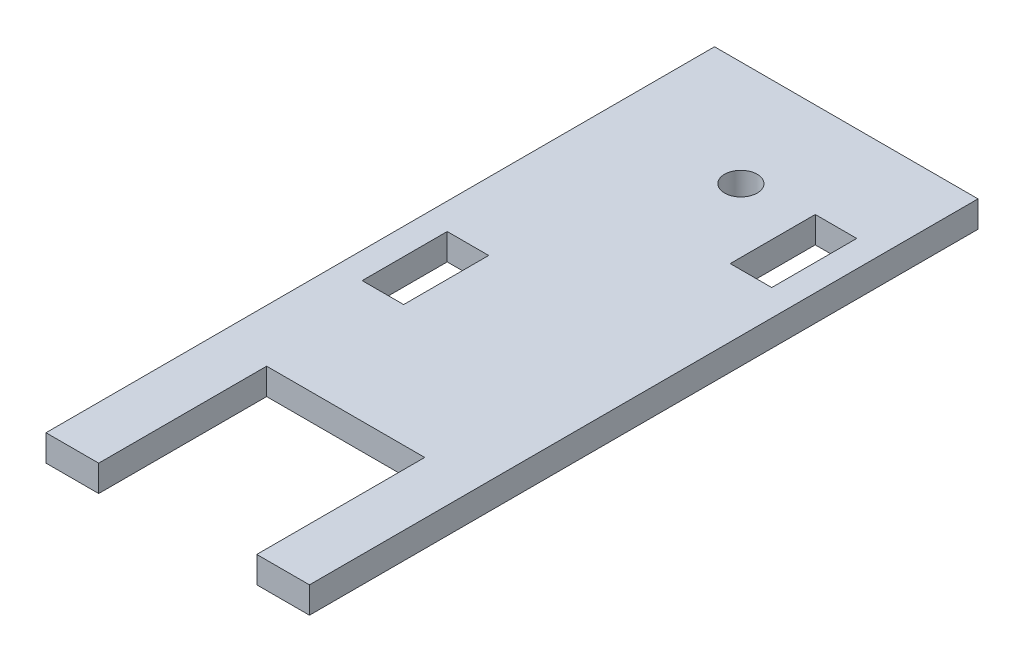
ISO-10303-21;
HEADER;
FILE_DESCRIPTION(('STEP AP214'),'2;1');
FILE_NAME('part.step','',(''),(''),'','','');
FILE_SCHEMA(('AUTOMOTIVE_DESIGN { 1 0 10303 214 1 1 1 1 }'));
ENDSEC;
DATA;
#1=APPLICATION_CONTEXT('core data for automotive mechanical design processes');
#2=APPLICATION_PROTOCOL_DEFINITION('international standard','automotive_design',2000,#1);
#3=PRODUCT_CONTEXT('',#1,'mechanical');
#4=PRODUCT('Part','Part','',(#3));
#5=PRODUCT_RELATED_PRODUCT_CATEGORY('part','',(#4));
#6=PRODUCT_DEFINITION_FORMATION('','',#4);
#7=PRODUCT_DEFINITION_CONTEXT('part definition',#1,'design');
#8=PRODUCT_DEFINITION('design','',#6,#7);
#9=PRODUCT_DEFINITION_SHAPE('','',#8);
#10=(LENGTH_UNIT() NAMED_UNIT(*) SI_UNIT(.MILLI.,.METRE.));
#11=(NAMED_UNIT(*) PLANE_ANGLE_UNIT() SI_UNIT($,.RADIAN.));
#12=(NAMED_UNIT(*) SI_UNIT($,.STERADIAN.) SOLID_ANGLE_UNIT());
#13=UNCERTAINTY_MEASURE_WITH_UNIT(LENGTH_MEASURE(1.E-05),#10,'distance_accuracy_value','');
#14=(GEOMETRIC_REPRESENTATION_CONTEXT(3) GLOBAL_UNCERTAINTY_ASSIGNED_CONTEXT((#13)) GLOBAL_UNIT_ASSIGNED_CONTEXT((#10,
#11,#12)) REPRESENTATION_CONTEXT('',''));
#15=CARTESIAN_POINT('',(0.,0.,0.));
#16=DIRECTION('',(0.,0.,1.));
#17=DIRECTION('',(1.,0.,0.));
#18=AXIS2_PLACEMENT_3D('',#15,#16,#17);
#19=CARTESIAN_POINT('',(0.,12.7,-241.3));
#20=DIRECTION('',(0.,0.,-1.));
#21=DIRECTION('',(-1.,0.,0.));
#22=AXIS2_PLACEMENT_3D('',#19,#20,#21);
#23=PLANE('',#22);
#24=DIRECTION('',(1.,0.,0.));
#25=VECTOR('',#24,1.);
#26=CARTESIAN_POINT('',(0.,0.,-241.3));
#27=LINE('',#26,#25);
#28=CARTESIAN_POINT('',(0.,0.,-241.3));
#29=VERTEX_POINT('',#28);
#30=CARTESIAN_POINT('',(127.,0.,-241.3));
#31=VERTEX_POINT('',#30);
#32=EDGE_CURVE('E245',#29,#31,#27,.T.);
#33=ORIENTED_EDGE('',*,*,#32,.F.);
#34=DIRECTION('',(0.,-1.,0.));
#35=VECTOR('',#34,1.);
#36=CARTESIAN_POINT('',(0.,12.7,-241.3));
#37=LINE('',#36,#35);
#38=CARTESIAN_POINT('',(0.,12.7,-241.3));
#39=VERTEX_POINT('',#38);
#40=EDGE_CURVE('E11',#39,#29,#37,.T.);
#41=ORIENTED_EDGE('',*,*,#40,.F.);
#42=DIRECTION('',(1.,0.,0.));
#43=VECTOR('',#42,1.);
#44=CARTESIAN_POINT('',(0.,12.7,-241.3));
#45=LINE('',#44,#43);
#46=CARTESIAN_POINT('',(127.,12.7,-241.3));
#47=VERTEX_POINT('',#46);
#48=EDGE_CURVE('E219',#39,#47,#45,.T.);
#49=ORIENTED_EDGE('',*,*,#48,.T.);
#50=DIRECTION('',(0.,-1.,0.));
#51=VECTOR('',#50,1.);
#52=CARTESIAN_POINT('',(127.,12.7,-241.3));
#53=LINE('',#52,#51);
#54=EDGE_CURVE('E242',#47,#31,#53,.T.);
#55=ORIENTED_EDGE('',*,*,#54,.T.);
#56=EDGE_LOOP('',(#33,#41,#49,#55));
#57=FACE_BOUND('',#56,.T.);
#58=ADVANCED_FACE('F35',(#57),#23,.T.);
#59=CARTESIAN_POINT('',(0.,12.7,0.));
#60=DIRECTION('',(-1.,0.,0.));
#61=DIRECTION('',(0.,0.,1.));
#62=AXIS2_PLACEMENT_3D('',#59,#60,#61);
#63=PLANE('',#62);
#64=DIRECTION('',(0.,0.,-1.));
#65=VECTOR('',#64,1.);
#66=CARTESIAN_POINT('',(0.,0.,0.));
#67=LINE('',#66,#65);
#68=CARTESIAN_POINT('',(0.,0.,80.9625));
#69=VERTEX_POINT('',#68);
#70=EDGE_CURVE('E248',#69,#29,#67,.T.);
#71=ORIENTED_EDGE('',*,*,#70,.F.);
#72=DIRECTION('',(0.,-1.,0.));
#73=VECTOR('',#72,1.);
#74=CARTESIAN_POINT('',(0.,12.7,80.9625));
#75=LINE('',#74,#73);
#76=CARTESIAN_POINT('',(0.,12.7,80.9625));
#77=VERTEX_POINT('',#76);
#78=EDGE_CURVE('E43',#77,#69,#75,.T.);
#79=ORIENTED_EDGE('',*,*,#78,.F.);
#80=DIRECTION('',(0.,0.,-1.));
#81=VECTOR('',#80,1.);
#82=CARTESIAN_POINT('',(0.,12.7,0.));
#83=LINE('',#82,#81);
#84=EDGE_CURVE('E223',#77,#39,#83,.T.);
#85=ORIENTED_EDGE('',*,*,#84,.T.);
#86=ORIENTED_EDGE('',*,*,#40,.T.);
#87=EDGE_LOOP('',(#71,#79,#85,#86));
#88=FACE_BOUND('',#87,.T.);
#89=ADVANCED_FACE('F286',(#88),#63,.T.);
#90=CARTESIAN_POINT('',(0.,12.7,80.9625));
#91=DIRECTION('',(0.,0.,1.));
#92=DIRECTION('',(1.,0.,0.));
#93=AXIS2_PLACEMENT_3D('',#90,#91,#92);
#94=PLANE('',#93);
#95=DIRECTION('',(-1.,0.,0.));
#96=VECTOR('',#95,1.);
#97=CARTESIAN_POINT('',(0.,0.,80.9625));
#98=LINE('',#97,#96);
#99=CARTESIAN_POINT('',(25.4,0.,80.9625));
#100=VERTEX_POINT('',#99);
#101=EDGE_CURVE('E251',#100,#69,#98,.T.);
#102=ORIENTED_EDGE('',*,*,#101,.F.);
#103=DIRECTION('',(0.,-1.,0.));
#104=VECTOR('',#103,1.);
#105=CARTESIAN_POINT('',(25.4,12.7,80.9625));
#106=LINE('',#105,#104);
#107=CARTESIAN_POINT('',(25.4,12.7,80.9625));
#108=VERTEX_POINT('',#107);
#109=EDGE_CURVE('E278',#108,#100,#106,.T.);
#110=ORIENTED_EDGE('',*,*,#109,.F.);
#111=DIRECTION('',(-1.,0.,0.));
#112=VECTOR('',#111,1.);
#113=CARTESIAN_POINT('',(0.,12.7,80.9625));
#114=LINE('',#113,#112);
#115=EDGE_CURVE('E226',#108,#77,#114,.T.);
#116=ORIENTED_EDGE('',*,*,#115,.T.);
#117=ORIENTED_EDGE('',*,*,#78,.T.);
#118=EDGE_LOOP('',(#102,#110,#116,#117));
#119=FACE_BOUND('',#118,.T.);
#120=ADVANCED_FACE('F282',(#119),#94,.T.);
#121=CARTESIAN_POINT('',(25.4,12.7,0.));
#122=DIRECTION('',(1.,0.,0.));
#123=DIRECTION('',(0.,0.,-1.));
#124=AXIS2_PLACEMENT_3D('',#121,#122,#123);
#125=PLANE('',#124);
#126=DIRECTION('',(0.,0.,1.));
#127=VECTOR('',#126,1.);
#128=CARTESIAN_POINT('',(25.4,0.,0.));
#129=LINE('',#128,#127);
#130=CARTESIAN_POINT('',(25.4,0.,0.));
#131=VERTEX_POINT('',#130);
#132=EDGE_CURVE('E254',#131,#100,#129,.T.);
#133=ORIENTED_EDGE('',*,*,#132,.F.);
#134=DIRECTION('',(0.,-1.,0.));
#135=VECTOR('',#134,1.);
#136=CARTESIAN_POINT('',(25.4,12.7,0.));
#137=LINE('',#136,#135);
#138=CARTESIAN_POINT('',(25.4,12.7,0.));
#139=VERTEX_POINT('',#138);
#140=EDGE_CURVE('E276',#139,#131,#137,.T.);
#141=ORIENTED_EDGE('',*,*,#140,.F.);
#142=DIRECTION('',(0.,0.,1.));
#143=VECTOR('',#142,1.);
#144=CARTESIAN_POINT('',(25.4,12.7,0.));
#145=LINE('',#144,#143);
#146=EDGE_CURVE('E229',#139,#108,#145,.T.);
#147=ORIENTED_EDGE('',*,*,#146,.T.);
#148=ORIENTED_EDGE('',*,*,#109,.T.);
#149=EDGE_LOOP('',(#133,#141,#147,#148));
#150=FACE_BOUND('',#149,.T.);
#151=ADVANCED_FACE('F293',(#150),#125,.T.);
#152=CARTESIAN_POINT('',(0.,12.7,0.));
#153=DIRECTION('',(0.,0.,-1.));
#154=DIRECTION('',(-1.,0.,0.));
#155=AXIS2_PLACEMENT_3D('',#152,#153,#154);
#156=PLANE('',#155);
#157=DIRECTION('',(1.,0.,0.));
#158=VECTOR('',#157,1.);
#159=CARTESIAN_POINT('',(0.,0.,0.));
#160=LINE('',#159,#158);
#161=CARTESIAN_POINT('',(101.6,0.,0.));
#162=VERTEX_POINT('',#161);
#163=EDGE_CURVE('E257',#131,#162,#160,.T.);
#164=ORIENTED_EDGE('',*,*,#163,.T.);
#165=DIRECTION('',(0.,-1.,0.));
#166=VECTOR('',#165,1.);
#167=CARTESIAN_POINT('',(101.6,12.7,0.));
#168=LINE('',#167,#166);
#169=CARTESIAN_POINT('',(101.6,12.7,0.));
#170=VERTEX_POINT('',#169);
#171=EDGE_CURVE('E273',#170,#162,#168,.T.);
#172=ORIENTED_EDGE('',*,*,#171,.F.);
#173=DIRECTION('',(1.,0.,0.));
#174=VECTOR('',#173,1.);
#175=CARTESIAN_POINT('',(0.,12.7,0.));
#176=LINE('',#175,#174);
#177=EDGE_CURVE('E232',#139,#170,#176,.T.);
#178=ORIENTED_EDGE('',*,*,#177,.F.);
#179=ORIENTED_EDGE('',*,*,#140,.T.);
#180=EDGE_LOOP('',(#164,#172,#178,#179));
#181=FACE_BOUND('',#180,.T.);
#182=ADVANCED_FACE('F312',(#181),#156,.F.);
#183=CARTESIAN_POINT('',(101.6,12.7,0.));
#184=DIRECTION('',(1.,0.,0.));
#185=DIRECTION('',(0.,0.,-1.));
#186=AXIS2_PLACEMENT_3D('',#183,#184,#185);
#187=PLANE('',#186);
#188=DIRECTION('',(0.,0.,1.));
#189=VECTOR('',#188,1.);
#190=CARTESIAN_POINT('',(101.6,0.,0.));
#191=LINE('',#190,#189);
#192=CARTESIAN_POINT('',(101.6,0.,80.9625));
#193=VERTEX_POINT('',#192);
#194=EDGE_CURVE('E260',#162,#193,#191,.T.);
#195=ORIENTED_EDGE('',*,*,#194,.T.);
#196=DIRECTION('',(0.,-1.,0.));
#197=VECTOR('',#196,1.);
#198=CARTESIAN_POINT('',(101.6,12.7,80.9625));
#199=LINE('',#198,#197);
#200=CARTESIAN_POINT('',(101.6,12.7,80.9625));
#201=VERTEX_POINT('',#200);
#202=EDGE_CURVE('E271',#201,#193,#199,.T.);
#203=ORIENTED_EDGE('',*,*,#202,.F.);
#204=DIRECTION('',(0.,0.,1.));
#205=VECTOR('',#204,1.);
#206=CARTESIAN_POINT('',(101.6,12.7,0.));
#207=LINE('',#206,#205);
#208=EDGE_CURVE('E235',#170,#201,#207,.T.);
#209=ORIENTED_EDGE('',*,*,#208,.F.);
#210=ORIENTED_EDGE('',*,*,#171,.T.);
#211=EDGE_LOOP('',(#195,#203,#209,#210));
#212=FACE_BOUND('',#211,.T.);
#213=ADVANCED_FACE('F309',(#212),#187,.F.);
#214=CARTESIAN_POINT('',(0.,12.7,80.9625));
#215=DIRECTION('',(0.,0.,1.));
#216=DIRECTION('',(1.,0.,0.));
#217=AXIS2_PLACEMENT_3D('',#214,#215,#216);
#218=PLANE('',#217);
#219=DIRECTION('',(-1.,0.,0.));
#220=VECTOR('',#219,1.);
#221=CARTESIAN_POINT('',(0.,0.,80.9625));
#222=LINE('',#221,#220);
#223=CARTESIAN_POINT('',(127.,0.,80.9625));
#224=VERTEX_POINT('',#223);
#225=EDGE_CURVE('E263',#224,#193,#222,.T.);
#226=ORIENTED_EDGE('',*,*,#225,.F.);
#227=DIRECTION('',(0.,-1.,0.));
#228=VECTOR('',#227,1.);
#229=CARTESIAN_POINT('',(127.,12.7,80.9625));
#230=LINE('',#229,#228);
#231=CARTESIAN_POINT('',(127.,12.7,80.9625));
#232=VERTEX_POINT('',#231);
#233=EDGE_CURVE('E269',#232,#224,#230,.T.);
#234=ORIENTED_EDGE('',*,*,#233,.F.);
#235=DIRECTION('',(-1.,0.,0.));
#236=VECTOR('',#235,1.);
#237=CARTESIAN_POINT('',(0.,12.7,80.9625));
#238=LINE('',#237,#236);
#239=EDGE_CURVE('E237',#232,#201,#238,.T.);
#240=ORIENTED_EDGE('',*,*,#239,.T.);
#241=ORIENTED_EDGE('',*,*,#202,.T.);
#242=EDGE_LOOP('',(#226,#234,#240,#241));
#243=FACE_BOUND('',#242,.T.);
#244=ADVANCED_FACE('F306',(#243),#218,.T.);
#245=CARTESIAN_POINT('',(63.5,12.7,-190.5));
#246=DIRECTION('',(0.,-1.,0.));
#247=DIRECTION('',(0.,0.,-1.));
#248=AXIS2_PLACEMENT_3D('',#245,#246,#247);
#249=CYLINDRICAL_SURFACE('',#248,7.874);
#250=CARTESIAN_POINT('',(63.5,12.7,-190.5));
#251=DIRECTION('',(0.,1.,0.));
#252=DIRECTION('',(0.,0.,1.));
#253=AXIS2_PLACEMENT_3D('',#250,#251,#252);
#254=CIRCLE('',#253,7.874);
#255=CARTESIAN_POINT('',(63.5,12.7,-182.626));
#256=VERTEX_POINT('',#255);
#257=EDGE_CURVE('E216',#256,#256,#254,.T.);
#258=ORIENTED_EDGE('',*,*,#257,.T.);
#259=EDGE_LOOP('',(#258));
#260=FACE_BOUND('',#259,.T.);
#261=CARTESIAN_POINT('',(63.5,0.,-190.5));
#262=DIRECTION('',(0.,1.,0.));
#263=DIRECTION('',(0.,0.,1.));
#264=AXIS2_PLACEMENT_3D('',#261,#262,#263);
#265=CIRCLE('',#264,7.874);
#266=CARTESIAN_POINT('',(63.5,0.,-182.626));
#267=VERTEX_POINT('',#266);
#268=EDGE_CURVE('E209',#267,#267,#265,.T.);
#269=ORIENTED_EDGE('',*,*,#268,.F.);
#270=EDGE_LOOP('',(#269));
#271=FACE_BOUND('',#270,.T.);
#272=ADVANCED_FACE('F37',(#260,#271),#249,.F.);
#273=CARTESIAN_POINT('',(127.,12.7,0.));
#274=DIRECTION('',(-1.,0.,0.));
#275=DIRECTION('',(0.,0.,1.));
#276=AXIS2_PLACEMENT_3D('',#273,#274,#275);
#277=PLANE('',#276);
#278=DIRECTION('',(0.,0.,-1.));
#279=VECTOR('',#278,1.);
#280=CARTESIAN_POINT('',(127.,0.,0.));
#281=LINE('',#280,#279);
#282=EDGE_CURVE('E220',#224,#31,#281,.T.);
#283=ORIENTED_EDGE('',*,*,#282,.T.);
#284=ORIENTED_EDGE('',*,*,#54,.F.);
#285=DIRECTION('',(0.,0.,-1.));
#286=VECTOR('',#285,1.);
#287=CARTESIAN_POINT('',(127.,12.7,0.));
#288=LINE('',#287,#286);
#289=EDGE_CURVE('E240',#232,#47,#288,.T.);
#290=ORIENTED_EDGE('',*,*,#289,.F.);
#291=ORIENTED_EDGE('',*,*,#233,.T.);
#292=EDGE_LOOP('',(#283,#284,#290,#291));
#293=FACE_BOUND('',#292,.T.);
#294=ADVANCED_FACE('F365',(#293),#277,.F.);
#295=CARTESIAN_POINT('',(0.,12.7,0.));
#296=DIRECTION('',(0.,1.,0.));
#297=DIRECTION('',(0.,0.,1.));
#298=AXIS2_PLACEMENT_3D('',#295,#296,#297);
#299=PLANE('',#298);
#300=DIRECTION('',(0.,0.,-1.));
#301=VECTOR('',#300,1.);
#302=CARTESIAN_POINT('',(12.7,12.7,-58.7375));
#303=LINE('',#302,#301);
#304=CARTESIAN_POINT('',(12.7,12.7,-58.7375));
#305=VERTEX_POINT('',#304);
#306=CARTESIAN_POINT('',(12.7,12.7,-99.7375));
#307=VERTEX_POINT('',#306);
#308=EDGE_CURVE('E149',#305,#307,#303,.T.);
#309=ORIENTED_EDGE('',*,*,#308,.T.);
#310=DIRECTION('',(1.,0.,0.));
#311=VECTOR('',#310,1.);
#312=CARTESIAN_POINT('',(12.7,12.7,-99.7375));
#313=LINE('',#312,#311);
#314=CARTESIAN_POINT('',(32.7,12.7,-99.7375));
#315=VERTEX_POINT('',#314);
#316=EDGE_CURVE('E158',#307,#315,#313,.T.);
#317=ORIENTED_EDGE('',*,*,#316,.T.);
#318=DIRECTION('',(0.,0.,1.));
#319=VECTOR('',#318,1.);
#320=CARTESIAN_POINT('',(32.7,12.7,-58.7375));
#321=LINE('',#320,#319);
#322=CARTESIAN_POINT('',(32.7,12.7,-58.7375));
#323=VERTEX_POINT('',#322);
#324=EDGE_CURVE('E50',#315,#323,#321,.T.);
#325=ORIENTED_EDGE('',*,*,#324,.T.);
#326=DIRECTION('',(-1.,0.,0.));
#327=VECTOR('',#326,1.);
#328=CARTESIAN_POINT('',(12.7,12.7,-58.7375));
#329=LINE('',#328,#327);
#330=EDGE_CURVE('E155',#323,#305,#329,.T.);
#331=ORIENTED_EDGE('',*,*,#330,.T.);
#332=EDGE_LOOP('',(#309,#317,#325,#331));
#333=FACE_BOUND('',#332,.T.);
#334=DIRECTION('',(0.,0.,1.));
#335=VECTOR('',#334,1.);
#336=CARTESIAN_POINT('',(114.3,12.7,-195.55319538));
#337=LINE('',#336,#335);
#338=CARTESIAN_POINT('',(114.3,12.7,-195.55319538));
#339=VERTEX_POINT('',#338);
#340=CARTESIAN_POINT('',(114.3,12.7,-154.55319538));
#341=VERTEX_POINT('',#340);
#342=EDGE_CURVE('E184',#339,#341,#337,.T.);
#343=ORIENTED_EDGE('',*,*,#342,.T.);
#344=DIRECTION('',(-1.,0.,0.));
#345=VECTOR('',#344,1.);
#346=CARTESIAN_POINT('',(114.3,12.7,-154.55319538));
#347=LINE('',#346,#345);
#348=CARTESIAN_POINT('',(94.3,12.7,-154.55319538));
#349=VERTEX_POINT('',#348);
#350=EDGE_CURVE('E187',#341,#349,#347,.T.);
#351=ORIENTED_EDGE('',*,*,#350,.T.);
#352=DIRECTION('',(0.,0.,-1.));
#353=VECTOR('',#352,1.);
#354=CARTESIAN_POINT('',(94.3,12.7,-195.55319538));
#355=LINE('',#354,#353);
#356=CARTESIAN_POINT('',(94.3,12.7,-195.55319538));
#357=VERTEX_POINT('',#356);
#358=EDGE_CURVE('E191',#349,#357,#355,.T.);
#359=ORIENTED_EDGE('',*,*,#358,.T.);
#360=DIRECTION('',(1.,0.,0.));
#361=VECTOR('',#360,1.);
#362=CARTESIAN_POINT('',(114.3,12.7,-195.55319538));
#363=LINE('',#362,#361);
#364=EDGE_CURVE('E194',#357,#339,#363,.T.);
#365=ORIENTED_EDGE('',*,*,#364,.T.);
#366=EDGE_LOOP('',(#343,#351,#359,#365));
#367=FACE_BOUND('',#366,.T.);
#368=ORIENTED_EDGE('',*,*,#257,.F.);
#369=EDGE_LOOP('',(#368));
#370=FACE_BOUND('',#369,.T.);
#371=ORIENTED_EDGE('',*,*,#48,.F.);
#372=ORIENTED_EDGE('',*,*,#84,.F.);
#373=ORIENTED_EDGE('',*,*,#115,.F.);
#374=ORIENTED_EDGE('',*,*,#146,.F.);
#375=ORIENTED_EDGE('',*,*,#177,.T.);
#376=ORIENTED_EDGE('',*,*,#208,.T.);
#377=ORIENTED_EDGE('',*,*,#239,.F.);
#378=ORIENTED_EDGE('',*,*,#289,.T.);
#379=EDGE_LOOP('',(#371,#372,#373,#374,#375,#376,#377,#378));
#380=FACE_BOUND('',#379,.T.);
#381=ADVANCED_FACE('F162',(#333,#367,#370,#380),#299,.T.);
#382=CARTESIAN_POINT('',(0.,0.,0.));
#383=DIRECTION('',(0.,1.,0.));
#384=DIRECTION('',(0.,0.,1.));
#385=AXIS2_PLACEMENT_3D('',#382,#383,#384);
#386=PLANE('',#385);
#387=DIRECTION('',(1.,0.,0.));
#388=VECTOR('',#387,1.);
#389=CARTESIAN_POINT('',(12.7,0.,-99.7375));
#390=LINE('',#389,#388);
#391=CARTESIAN_POINT('',(12.7,0.,-99.7375));
#392=VERTEX_POINT('',#391);
#393=CARTESIAN_POINT('',(32.7,0.,-99.7375));
#394=VERTEX_POINT('',#393);
#395=EDGE_CURVE('E174',#392,#394,#390,.T.);
#396=ORIENTED_EDGE('',*,*,#395,.F.);
#397=DIRECTION('',(0.,0.,-1.));
#398=VECTOR('',#397,1.);
#399=CARTESIAN_POINT('',(12.7,0.,-58.7375));
#400=LINE('',#399,#398);
#401=CARTESIAN_POINT('',(12.7,0.,-58.7375));
#402=VERTEX_POINT('',#401);
#403=EDGE_CURVE('E58',#402,#392,#400,.T.);
#404=ORIENTED_EDGE('',*,*,#403,.F.);
#405=DIRECTION('',(-1.,0.,0.));
#406=VECTOR('',#405,1.);
#407=CARTESIAN_POINT('',(12.7,0.,-58.7375));
#408=LINE('',#407,#406);
#409=CARTESIAN_POINT('',(32.7,0.,-58.7375));
#410=VERTEX_POINT('',#409);
#411=EDGE_CURVE('E165',#410,#402,#408,.T.);
#412=ORIENTED_EDGE('',*,*,#411,.F.);
#413=DIRECTION('',(0.,0.,1.));
#414=VECTOR('',#413,1.);
#415=CARTESIAN_POINT('',(32.7,0.,-58.7375));
#416=LINE('',#415,#414);
#417=EDGE_CURVE('E168',#394,#410,#416,.T.);
#418=ORIENTED_EDGE('',*,*,#417,.F.);
#419=EDGE_LOOP('',(#396,#404,#412,#418));
#420=FACE_BOUND('',#419,.T.);
#421=DIRECTION('',(-1.,0.,0.));
#422=VECTOR('',#421,1.);
#423=CARTESIAN_POINT('',(114.3,0.,-154.55319538));
#424=LINE('',#423,#422);
#425=CARTESIAN_POINT('',(114.3,0.,-154.55319538));
#426=VERTEX_POINT('',#425);
#427=CARTESIAN_POINT('',(94.3,0.,-154.55319538));
#428=VERTEX_POINT('',#427);
#429=EDGE_CURVE('E199',#426,#428,#424,.T.);
#430=ORIENTED_EDGE('',*,*,#429,.F.);
#431=DIRECTION('',(0.,0.,1.));
#432=VECTOR('',#431,1.);
#433=CARTESIAN_POINT('',(114.3,0.,-195.55319538));
#434=LINE('',#433,#432);
#435=CARTESIAN_POINT('',(114.3,0.,-195.55319538));
#436=VERTEX_POINT('',#435);
#437=EDGE_CURVE('E180',#436,#426,#434,.T.);
#438=ORIENTED_EDGE('',*,*,#437,.F.);
#439=DIRECTION('',(1.,0.,0.));
#440=VECTOR('',#439,1.);
#441=CARTESIAN_POINT('',(114.3,0.,-195.55319538));
#442=LINE('',#441,#440);
#443=CARTESIAN_POINT('',(94.3,0.,-195.55319538));
#444=VERTEX_POINT('',#443);
#445=EDGE_CURVE('E188',#444,#436,#442,.T.);
#446=ORIENTED_EDGE('',*,*,#445,.F.);
#447=DIRECTION('',(0.,0.,-1.));
#448=VECTOR('',#447,1.);
#449=CARTESIAN_POINT('',(94.3,0.,-195.55319538));
#450=LINE('',#449,#448);
#451=EDGE_CURVE('E202',#428,#444,#450,.T.);
#452=ORIENTED_EDGE('',*,*,#451,.F.);
#453=EDGE_LOOP('',(#430,#438,#446,#452));
#454=FACE_BOUND('',#453,.T.);
#455=ORIENTED_EDGE('',*,*,#268,.T.);
#456=EDGE_LOOP('',(#455));
#457=FACE_BOUND('',#456,.T.);
#458=ORIENTED_EDGE('',*,*,#32,.T.);
#459=ORIENTED_EDGE('',*,*,#282,.F.);
#460=ORIENTED_EDGE('',*,*,#225,.T.);
#461=ORIENTED_EDGE('',*,*,#194,.F.);
#462=ORIENTED_EDGE('',*,*,#163,.F.);
#463=ORIENTED_EDGE('',*,*,#132,.T.);
#464=ORIENTED_EDGE('',*,*,#101,.T.);
#465=ORIENTED_EDGE('',*,*,#70,.T.);
#466=EDGE_LOOP('',(#458,#459,#460,#461,#462,#463,#464,#465));
#467=FACE_BOUND('',#466,.T.);
#468=ADVANCED_FACE('F289',(#420,#454,#457,#467),#386,.F.);
#469=CARTESIAN_POINT('',(114.3,12.7,-195.55319538));
#470=DIRECTION('',(1.,0.,0.));
#471=DIRECTION('',(0.,0.,-1.));
#472=AXIS2_PLACEMENT_3D('',#469,#470,#471);
#473=PLANE('',#472);
#474=ORIENTED_EDGE('',*,*,#437,.T.);
#475=DIRECTION('',(0.,-1.,0.));
#476=VECTOR('',#475,1.);
#477=CARTESIAN_POINT('',(114.3,12.7,-154.55319538));
#478=LINE('',#477,#476);
#479=EDGE_CURVE('E197',#341,#426,#478,.T.);
#480=ORIENTED_EDGE('',*,*,#479,.F.);
#481=ORIENTED_EDGE('',*,*,#342,.F.);
#482=DIRECTION('',(0.,-1.,0.));
#483=VECTOR('',#482,1.);
#484=CARTESIAN_POINT('',(114.3,12.7,-195.55319538));
#485=LINE('',#484,#483);
#486=EDGE_CURVE('E207',#339,#436,#485,.T.);
#487=ORIENTED_EDGE('',*,*,#486,.T.);
#488=EDGE_LOOP('',(#474,#480,#481,#487));
#489=FACE_BOUND('',#488,.T.);
#490=ADVANCED_FACE('F381',(#489),#473,.F.);
#491=CARTESIAN_POINT('',(114.3,12.7,-195.55319538));
#492=DIRECTION('',(0.,0.,-1.));
#493=DIRECTION('',(-1.,0.,0.));
#494=AXIS2_PLACEMENT_3D('',#491,#492,#493);
#495=PLANE('',#494);
#496=ORIENTED_EDGE('',*,*,#445,.T.);
#497=ORIENTED_EDGE('',*,*,#486,.F.);
#498=ORIENTED_EDGE('',*,*,#364,.F.);
#499=DIRECTION('',(0.,-1.,0.));
#500=VECTOR('',#499,1.);
#501=CARTESIAN_POINT('',(94.3,12.7,-195.55319538));
#502=LINE('',#501,#500);
#503=EDGE_CURVE('E210',#357,#444,#502,.T.);
#504=ORIENTED_EDGE('',*,*,#503,.T.);
#505=EDGE_LOOP('',(#496,#497,#498,#504));
#506=FACE_BOUND('',#505,.T.);
#507=ADVANCED_FACE('F386',(#506),#495,.F.);
#508=CARTESIAN_POINT('',(94.3,12.7,-195.55319538));
#509=DIRECTION('',(-1.,0.,0.));
#510=DIRECTION('',(0.,0.,1.));
#511=AXIS2_PLACEMENT_3D('',#508,#509,#510);
#512=PLANE('',#511);
#513=ORIENTED_EDGE('',*,*,#451,.T.);
#514=ORIENTED_EDGE('',*,*,#503,.F.);
#515=ORIENTED_EDGE('',*,*,#358,.F.);
#516=DIRECTION('',(0.,-1.,0.));
#517=VECTOR('',#516,1.);
#518=CARTESIAN_POINT('',(94.3,12.7,-154.55319538));
#519=LINE('',#518,#517);
#520=EDGE_CURVE('E212',#349,#428,#519,.T.);
#521=ORIENTED_EDGE('',*,*,#520,.T.);
#522=EDGE_LOOP('',(#513,#514,#515,#521));
#523=FACE_BOUND('',#522,.T.);
#524=ADVANCED_FACE('F398',(#523),#512,.F.);
#525=CARTESIAN_POINT('',(114.3,12.7,-154.55319538));
#526=DIRECTION('',(0.,0.,1.));
#527=DIRECTION('',(1.,0.,0.));
#528=AXIS2_PLACEMENT_3D('',#525,#526,#527);
#529=PLANE('',#528);
#530=ORIENTED_EDGE('',*,*,#429,.T.);
#531=ORIENTED_EDGE('',*,*,#520,.F.);
#532=ORIENTED_EDGE('',*,*,#350,.F.);
#533=ORIENTED_EDGE('',*,*,#479,.T.);
#534=EDGE_LOOP('',(#530,#531,#532,#533));
#535=FACE_BOUND('',#534,.T.);
#536=ADVANCED_FACE('F408',(#535),#529,.F.);
#537=CARTESIAN_POINT('',(12.7,12.7,-58.7375));
#538=DIRECTION('',(-1.,0.,0.));
#539=DIRECTION('',(0.,0.,1.));
#540=AXIS2_PLACEMENT_3D('',#537,#538,#539);
#541=PLANE('',#540);
#542=ORIENTED_EDGE('',*,*,#403,.T.);
#543=DIRECTION('',(0.,-1.,0.));
#544=VECTOR('',#543,1.);
#545=CARTESIAN_POINT('',(12.7,12.7,-99.7375));
#546=LINE('',#545,#544);
#547=EDGE_CURVE('E145',#307,#392,#546,.T.);
#548=ORIENTED_EDGE('',*,*,#547,.F.);
#549=ORIENTED_EDGE('',*,*,#308,.F.);
#550=DIRECTION('',(0.,-1.,0.));
#551=VECTOR('',#550,1.);
#552=CARTESIAN_POINT('',(12.7,12.7,-58.7375));
#553=LINE('',#552,#551);
#554=EDGE_CURVE('E178',#305,#402,#553,.T.);
#555=ORIENTED_EDGE('',*,*,#554,.T.);
#556=EDGE_LOOP('',(#542,#548,#549,#555));
#557=FACE_BOUND('',#556,.T.);
#558=ADVANCED_FACE('F147',(#557),#541,.F.);
#559=CARTESIAN_POINT('',(12.7,12.7,-58.7375));
#560=DIRECTION('',(0.,0.,1.));
#561=DIRECTION('',(1.,0.,0.));
#562=AXIS2_PLACEMENT_3D('',#559,#560,#561);
#563=PLANE('',#562);
#564=ORIENTED_EDGE('',*,*,#411,.T.);
#565=ORIENTED_EDGE('',*,*,#554,.F.);
#566=ORIENTED_EDGE('',*,*,#330,.F.);
#567=DIRECTION('',(0.,-1.,0.));
#568=VECTOR('',#567,1.);
#569=CARTESIAN_POINT('',(32.7,12.7,-58.7375));
#570=LINE('',#569,#568);
#571=EDGE_CURVE('E181',#323,#410,#570,.T.);
#572=ORIENTED_EDGE('',*,*,#571,.T.);
#573=EDGE_LOOP('',(#564,#565,#566,#572));
#574=FACE_BOUND('',#573,.T.);
#575=ADVANCED_FACE('F437',(#574),#563,.F.);
#576=CARTESIAN_POINT('',(32.7,12.7,-58.7375));
#577=DIRECTION('',(1.,0.,0.));
#578=DIRECTION('',(0.,0.,-1.));
#579=AXIS2_PLACEMENT_3D('',#576,#577,#578);
#580=PLANE('',#579);
#581=ORIENTED_EDGE('',*,*,#417,.T.);
#582=ORIENTED_EDGE('',*,*,#571,.F.);
#583=ORIENTED_EDGE('',*,*,#324,.F.);
#584=DIRECTION('',(0.,-1.,0.));
#585=VECTOR('',#584,1.);
#586=CARTESIAN_POINT('',(32.7,12.7,-99.7375));
#587=LINE('',#586,#585);
#588=EDGE_CURVE('E154',#315,#394,#587,.T.);
#589=ORIENTED_EDGE('',*,*,#588,.T.);
#590=EDGE_LOOP('',(#581,#582,#583,#589));
#591=FACE_BOUND('',#590,.T.);
#592=ADVANCED_FACE('F446',(#591),#580,.F.);
#593=CARTESIAN_POINT('',(12.7,12.7,-99.7375));
#594=DIRECTION('',(0.,0.,-1.));
#595=DIRECTION('',(-1.,0.,0.));
#596=AXIS2_PLACEMENT_3D('',#593,#594,#595);
#597=PLANE('',#596);
#598=ORIENTED_EDGE('',*,*,#395,.T.);
#599=ORIENTED_EDGE('',*,*,#588,.F.);
#600=ORIENTED_EDGE('',*,*,#316,.F.);
#601=ORIENTED_EDGE('',*,*,#547,.T.);
#602=EDGE_LOOP('',(#598,#599,#600,#601));
#603=FACE_BOUND('',#602,.T.);
#604=ADVANCED_FACE('F159',(#603),#597,.F.);
#605=CLOSED_SHELL('',(#58,#89,#120,#151,#182,#213,#244,#272,#294,#381,#468,#490,#507,#524,#536,
#558,#575,#592,#604));
#606=MANIFOLD_SOLID_BREP('B2',#605);
#607=ADVANCED_BREP_SHAPE_REPRESENTATION('',(#18,#606),#14);
#608=SHAPE_DEFINITION_REPRESENTATION(#9,#607);
ENDSEC;
END-ISO-10303-21;
